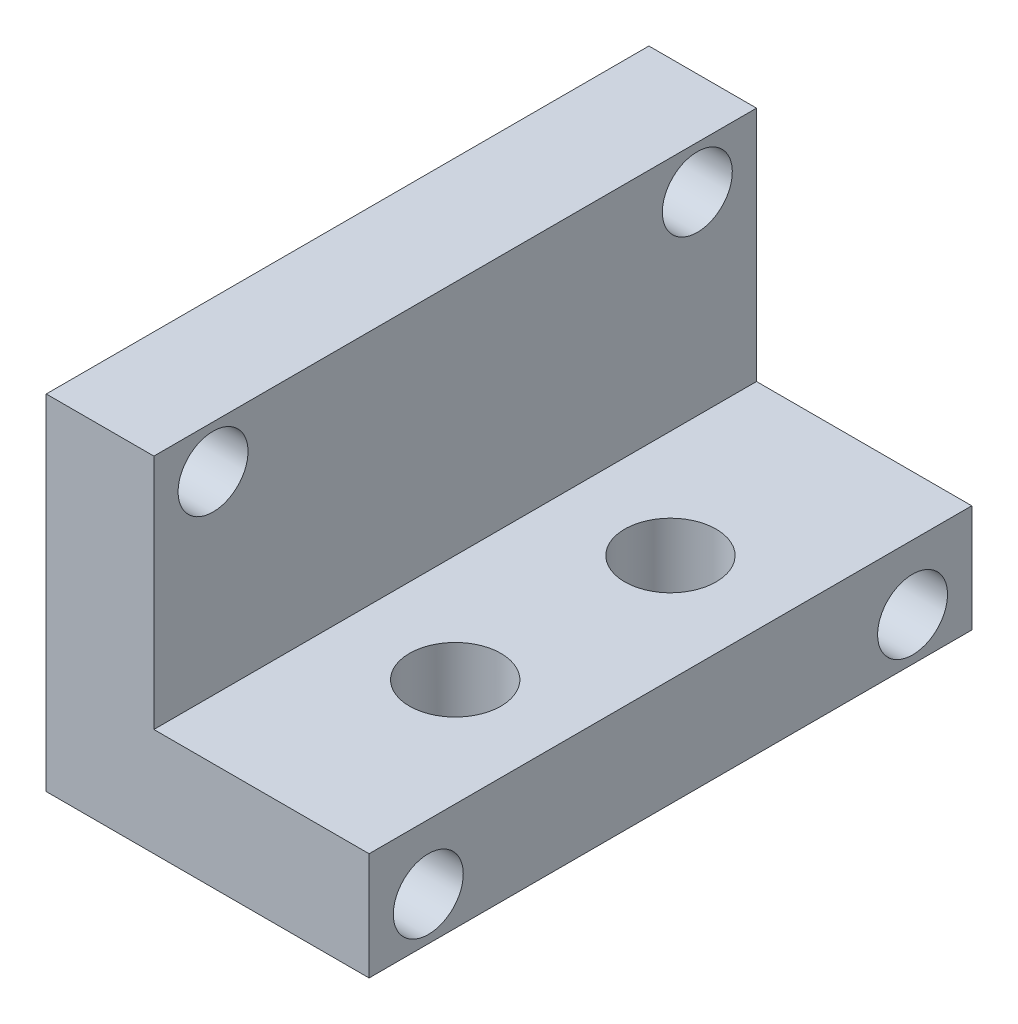
ISO-10303-21;
HEADER;
FILE_DESCRIPTION(('STEP AP214'),'2;1');
FILE_NAME('part.step','',(''),(''),'','','');
FILE_SCHEMA(('AUTOMOTIVE_DESIGN { 1 0 10303 214 1 1 1 1 }'));
ENDSEC;
DATA;
#1=APPLICATION_CONTEXT('core data for automotive mechanical design processes');
#2=APPLICATION_PROTOCOL_DEFINITION('international standard','automotive_design',2000,#1);
#3=PRODUCT_CONTEXT('',#1,'mechanical');
#4=PRODUCT('Part','Part','',(#3));
#5=PRODUCT_RELATED_PRODUCT_CATEGORY('part','',(#4));
#6=PRODUCT_DEFINITION_FORMATION('','',#4);
#7=PRODUCT_DEFINITION_CONTEXT('part definition',#1,'design');
#8=PRODUCT_DEFINITION('design','',#6,#7);
#9=PRODUCT_DEFINITION_SHAPE('','',#8);
#10=(LENGTH_UNIT() NAMED_UNIT(*) SI_UNIT(.MILLI.,.METRE.));
#11=(NAMED_UNIT(*) PLANE_ANGLE_UNIT() SI_UNIT($,.RADIAN.));
#12=(NAMED_UNIT(*) SI_UNIT($,.STERADIAN.) SOLID_ANGLE_UNIT());
#13=UNCERTAINTY_MEASURE_WITH_UNIT(LENGTH_MEASURE(1.E-05),#10,'distance_accuracy_value','');
#14=(GEOMETRIC_REPRESENTATION_CONTEXT(3) GLOBAL_UNCERTAINTY_ASSIGNED_CONTEXT((#13)) GLOBAL_UNIT_ASSIGNED_CONTEXT((#10,
#11,#12)) REPRESENTATION_CONTEXT('',''));
#15=CARTESIAN_POINT('',(0.,0.,0.));
#16=DIRECTION('',(0.,0.,1.));
#17=DIRECTION('',(1.,0.,0.));
#18=AXIS2_PLACEMENT_3D('',#15,#16,#17);
#19=CARTESIAN_POINT('',(0.,-16.,28.));
#20=DIRECTION('',(1.,0.,0.));
#21=DIRECTION('',(0.,0.,-1.));
#22=AXIS2_PLACEMENT_3D('',#19,#20,#21);
#23=PLANE('',#22);
#24=CARTESIAN_POINT('',(0.,-2.,2.75));
#25=DIRECTION('',(-1.,0.,0.));
#26=DIRECTION('',(0.,0.,-1.));
#27=AXIS2_PLACEMENT_3D('',#24,#25,#26);
#28=CIRCLE('',#27,1.625);
#29=CARTESIAN_POINT('',(0.,-2.,1.125));
#30=VERTEX_POINT('',#29);
#31=EDGE_CURVE('E155',#30,#30,#28,.T.);
#32=ORIENTED_EDGE('',*,*,#31,.F.);
#33=EDGE_LOOP('',(#32));
#34=FACE_BOUND('',#33,.T.);
#35=CARTESIAN_POINT('',(0.,-14.,25.25));
#36=DIRECTION('',(-1.,0.,0.));
#37=DIRECTION('',(0.,0.,-1.));
#38=AXIS2_PLACEMENT_3D('',#35,#36,#37);
#39=CIRCLE('',#38,1.625);
#40=CARTESIAN_POINT('',(0.,-14.,23.625));
#41=VERTEX_POINT('',#40);
#42=EDGE_CURVE('E192',#41,#41,#39,.T.);
#43=ORIENTED_EDGE('',*,*,#42,.F.);
#44=EDGE_LOOP('',(#43));
#45=FACE_BOUND('',#44,.T.);
#46=CARTESIAN_POINT('',(0.,-14.,2.75));
#47=DIRECTION('',(-1.,0.,0.));
#48=DIRECTION('',(0.,0.,1.));
#49=AXIS2_PLACEMENT_3D('',#46,#47,#48);
#50=CIRCLE('',#49,1.625);
#51=CARTESIAN_POINT('',(0.,-14.,4.375));
#52=VERTEX_POINT('',#51);
#53=EDGE_CURVE('E151',#52,#52,#50,.T.);
#54=ORIENTED_EDGE('',*,*,#53,.F.);
#55=EDGE_LOOP('',(#54));
#56=FACE_BOUND('',#55,.T.);
#57=CARTESIAN_POINT('',(0.,-2.,25.25));
#58=DIRECTION('',(-1.,0.,0.));
#59=DIRECTION('',(0.,0.,1.));
#60=AXIS2_PLACEMENT_3D('',#57,#58,#59);
#61=CIRCLE('',#60,1.625);
#62=CARTESIAN_POINT('',(0.,-2.,26.875));
#63=VERTEX_POINT('',#62);
#64=EDGE_CURVE('E141',#63,#63,#61,.T.);
#65=ORIENTED_EDGE('',*,*,#64,.F.);
#66=EDGE_LOOP('',(#65));
#67=FACE_BOUND('',#66,.T.);
#68=DIRECTION('',(0.,-1.,0.));
#69=VECTOR('',#68,1.);
#70=CARTESIAN_POINT('',(0.,-16.,0.));
#71=LINE('',#70,#69);
#72=CARTESIAN_POINT('',(0.,0.,0.));
#73=VERTEX_POINT('',#72);
#74=CARTESIAN_POINT('',(0.,-16.,0.));
#75=VERTEX_POINT('',#74);
#76=EDGE_CURVE('E124',#73,#75,#71,.T.);
#77=ORIENTED_EDGE('',*,*,#76,.T.);
#78=DIRECTION('',(0.,0.,-1.));
#79=VECTOR('',#78,1.);
#80=CARTESIAN_POINT('',(0.,-16.,28.));
#81=LINE('',#80,#79);
#82=CARTESIAN_POINT('',(0.,-16.,28.));
#83=VERTEX_POINT('',#82);
#84=EDGE_CURVE('E11',#83,#75,#81,.T.);
#85=ORIENTED_EDGE('',*,*,#84,.F.);
#86=DIRECTION('',(0.,-1.,0.));
#87=VECTOR('',#86,1.);
#88=CARTESIAN_POINT('',(0.,-16.,28.));
#89=LINE('',#88,#87);
#90=CARTESIAN_POINT('',(0.,0.,28.));
#91=VERTEX_POINT('',#90);
#92=EDGE_CURVE('E134',#91,#83,#89,.T.);
#93=ORIENTED_EDGE('',*,*,#92,.F.);
#94=DIRECTION('',(0.,0.,-1.));
#95=VECTOR('',#94,1.);
#96=CARTESIAN_POINT('',(0.,0.,28.));
#97=LINE('',#96,#95);
#98=EDGE_CURVE('E120',#91,#73,#97,.T.);
#99=ORIENTED_EDGE('',*,*,#98,.T.);
#100=EDGE_LOOP('',(#77,#85,#93,#99));
#101=FACE_BOUND('',#100,.T.);
#102=ADVANCED_FACE('F38',(#34,#45,#56,#67,#101),#23,.F.);
#103=CARTESIAN_POINT('',(15.,-16.,28.));
#104=DIRECTION('',(0.,1.,0.));
#105=DIRECTION('',(0.,0.,1.));
#106=AXIS2_PLACEMENT_3D('',#103,#104,#105);
#107=PLANE('',#106);
#108=CARTESIAN_POINT('',(10.,-16.,9.));
#109=DIRECTION('',(0.,1.,0.));
#110=DIRECTION('',(0.,0.,1.));
#111=AXIS2_PLACEMENT_3D('',#108,#109,#110);
#112=CIRCLE('',#111,2.125);
#113=CARTESIAN_POINT('',(10.,-16.,11.125));
#114=VERTEX_POINT('',#113);
#115=EDGE_CURVE('E203',#114,#114,#112,.T.);
#116=ORIENTED_EDGE('',*,*,#115,.T.);
#117=EDGE_LOOP('',(#116));
#118=FACE_BOUND('',#117,.T.);
#119=CARTESIAN_POINT('',(10.,-16.,19.));
#120=DIRECTION('',(0.,1.,0.));
#121=DIRECTION('',(0.,0.,1.));
#122=AXIS2_PLACEMENT_3D('',#119,#120,#121);
#123=CIRCLE('',#122,2.125);
#124=CARTESIAN_POINT('',(10.,-16.,21.125));
#125=VERTEX_POINT('',#124);
#126=EDGE_CURVE('E206',#125,#125,#123,.T.);
#127=ORIENTED_EDGE('',*,*,#126,.T.);
#128=EDGE_LOOP('',(#127));
#129=FACE_BOUND('',#128,.T.);
#130=DIRECTION('',(1.,0.,0.));
#131=VECTOR('',#130,1.);
#132=CARTESIAN_POINT('',(15.,-16.,0.));
#133=LINE('',#132,#131);
#134=CARTESIAN_POINT('',(15.,-16.,0.));
#135=VERTEX_POINT('',#134);
#136=EDGE_CURVE('E127',#75,#135,#133,.T.);
#137=ORIENTED_EDGE('',*,*,#136,.T.);
#138=DIRECTION('',(0.,0.,-1.));
#139=VECTOR('',#138,1.);
#140=CARTESIAN_POINT('',(15.,-16.,28.));
#141=LINE('',#140,#139);
#142=CARTESIAN_POINT('',(15.,-16.,28.));
#143=VERTEX_POINT('',#142);
#144=EDGE_CURVE('E47',#143,#135,#141,.T.);
#145=ORIENTED_EDGE('',*,*,#144,.F.);
#146=DIRECTION('',(1.,0.,0.));
#147=VECTOR('',#146,1.);
#148=CARTESIAN_POINT('',(15.,-16.,28.));
#149=LINE('',#148,#147);
#150=EDGE_CURVE('E93',#83,#143,#149,.T.);
#151=ORIENTED_EDGE('',*,*,#150,.F.);
#152=ORIENTED_EDGE('',*,*,#84,.T.);
#153=EDGE_LOOP('',(#137,#145,#151,#152));
#154=FACE_BOUND('',#153,.T.);
#155=ADVANCED_FACE('F160',(#118,#129,#154),#107,.F.);
#156=CARTESIAN_POINT('',(15.,-11.,28.));
#157=DIRECTION('',(-1.,0.,0.));
#158=DIRECTION('',(0.,0.,1.));
#159=AXIS2_PLACEMENT_3D('',#156,#157,#158);
#160=PLANE('',#159);
#161=CARTESIAN_POINT('',(15.,-14.,25.25));
#162=DIRECTION('',(-1.,0.,0.));
#163=DIRECTION('',(0.,0.,-1.));
#164=AXIS2_PLACEMENT_3D('',#161,#162,#163);
#165=CIRCLE('',#164,1.625);
#166=CARTESIAN_POINT('',(15.,-14.,23.625));
#167=VERTEX_POINT('',#166);
#168=EDGE_CURVE('E197',#167,#167,#165,.T.);
#169=ORIENTED_EDGE('',*,*,#168,.T.);
#170=EDGE_LOOP('',(#169));
#171=FACE_BOUND('',#170,.T.);
#172=CARTESIAN_POINT('',(15.,-14.,2.75));
#173=DIRECTION('',(-1.,0.,0.));
#174=DIRECTION('',(0.,0.,1.));
#175=AXIS2_PLACEMENT_3D('',#172,#173,#174);
#176=CIRCLE('',#175,1.625);
#177=CARTESIAN_POINT('',(15.,-14.,4.375));
#178=VERTEX_POINT('',#177);
#179=EDGE_CURVE('E146',#178,#178,#176,.T.);
#180=ORIENTED_EDGE('',*,*,#179,.T.);
#181=EDGE_LOOP('',(#180));
#182=FACE_BOUND('',#181,.T.);
#183=DIRECTION('',(0.,1.,0.));
#184=VECTOR('',#183,1.);
#185=CARTESIAN_POINT('',(15.,-11.,0.));
#186=LINE('',#185,#184);
#187=CARTESIAN_POINT('',(15.,-11.,0.));
#188=VERTEX_POINT('',#187);
#189=EDGE_CURVE('E129',#135,#188,#186,.T.);
#190=ORIENTED_EDGE('',*,*,#189,.T.);
#191=DIRECTION('',(0.,0.,-1.));
#192=VECTOR('',#191,1.);
#193=CARTESIAN_POINT('',(15.,-11.,28.));
#194=LINE('',#193,#192);
#195=CARTESIAN_POINT('',(15.,-11.,28.));
#196=VERTEX_POINT('',#195);
#197=EDGE_CURVE('E115',#196,#188,#194,.T.);
#198=ORIENTED_EDGE('',*,*,#197,.F.);
#199=DIRECTION('',(0.,1.,0.));
#200=VECTOR('',#199,1.);
#201=CARTESIAN_POINT('',(15.,-11.,28.));
#202=LINE('',#201,#200);
#203=EDGE_CURVE('E106',#143,#196,#202,.T.);
#204=ORIENTED_EDGE('',*,*,#203,.F.);
#205=ORIENTED_EDGE('',*,*,#144,.T.);
#206=EDGE_LOOP('',(#190,#198,#204,#205));
#207=FACE_BOUND('',#206,.T.);
#208=ADVANCED_FACE('F163',(#171,#182,#207),#160,.F.);
#209=CARTESIAN_POINT('',(5.,-11.,28.));
#210=DIRECTION('',(0.,-1.,0.));
#211=DIRECTION('',(0.,0.,-1.));
#212=AXIS2_PLACEMENT_3D('',#209,#210,#211);
#213=PLANE('',#212);
#214=CARTESIAN_POINT('',(10.,-11.,9.));
#215=DIRECTION('',(0.,1.,0.));
#216=DIRECTION('',(0.,0.,1.));
#217=AXIS2_PLACEMENT_3D('',#214,#215,#216);
#218=CIRCLE('',#217,2.125);
#219=CARTESIAN_POINT('',(10.,-11.,11.125));
#220=VERTEX_POINT('',#219);
#221=EDGE_CURVE('E209',#220,#220,#218,.T.);
#222=ORIENTED_EDGE('',*,*,#221,.F.);
#223=EDGE_LOOP('',(#222));
#224=FACE_BOUND('',#223,.T.);
#225=CARTESIAN_POINT('',(10.,-11.,19.));
#226=DIRECTION('',(0.,1.,0.));
#227=DIRECTION('',(0.,0.,-1.));
#228=AXIS2_PLACEMENT_3D('',#225,#226,#227);
#229=CIRCLE('',#228,2.125);
#230=CARTESIAN_POINT('',(10.,-11.,16.875));
#231=VERTEX_POINT('',#230);
#232=EDGE_CURVE('E212',#231,#231,#229,.T.);
#233=ORIENTED_EDGE('',*,*,#232,.F.);
#234=EDGE_LOOP('',(#233));
#235=FACE_BOUND('',#234,.T.);
#236=DIRECTION('',(-1.,0.,0.));
#237=VECTOR('',#236,1.);
#238=CARTESIAN_POINT('',(5.,-11.,0.));
#239=LINE('',#238,#237);
#240=CARTESIAN_POINT('',(5.,-11.,0.));
#241=VERTEX_POINT('',#240);
#242=EDGE_CURVE('E114',#188,#241,#239,.T.);
#243=ORIENTED_EDGE('',*,*,#242,.T.);
#244=DIRECTION('',(0.,0.,-1.));
#245=VECTOR('',#244,1.);
#246=CARTESIAN_POINT('',(5.,-11.,28.));
#247=LINE('',#246,#245);
#248=CARTESIAN_POINT('',(5.,-11.,28.));
#249=VERTEX_POINT('',#248);
#250=EDGE_CURVE('E111',#249,#241,#247,.T.);
#251=ORIENTED_EDGE('',*,*,#250,.F.);
#252=DIRECTION('',(-1.,0.,0.));
#253=VECTOR('',#252,1.);
#254=CARTESIAN_POINT('',(5.,-11.,28.));
#255=LINE('',#254,#253);
#256=EDGE_CURVE('E100',#196,#249,#255,.T.);
#257=ORIENTED_EDGE('',*,*,#256,.F.);
#258=ORIENTED_EDGE('',*,*,#197,.T.);
#259=EDGE_LOOP('',(#243,#251,#257,#258));
#260=FACE_BOUND('',#259,.T.);
#261=ADVANCED_FACE('F112',(#224,#235,#260),#213,.F.);
#262=CARTESIAN_POINT('',(5.,0.,28.));
#263=DIRECTION('',(-1.,0.,0.));
#264=DIRECTION('',(0.,-1.,0.));
#265=AXIS2_PLACEMENT_3D('',#262,#263,#264);
#266=PLANE('',#265);
#267=CARTESIAN_POINT('',(5.,-2.,2.75));
#268=DIRECTION('',(-1.,0.,0.));
#269=DIRECTION('',(0.,-1.,0.));
#270=AXIS2_PLACEMENT_3D('',#267,#268,#269);
#271=CIRCLE('',#270,1.625);
#272=CARTESIAN_POINT('',(5.,-3.625,2.75));
#273=VERTEX_POINT('',#272);
#274=EDGE_CURVE('E41',#273,#273,#271,.T.);
#275=ORIENTED_EDGE('',*,*,#274,.T.);
#276=EDGE_LOOP('',(#275));
#277=FACE_BOUND('',#276,.T.);
#278=CARTESIAN_POINT('',(5.,-2.,25.25));
#279=DIRECTION('',(-1.,0.,0.));
#280=DIRECTION('',(0.,-1.,0.));
#281=AXIS2_PLACEMENT_3D('',#278,#279,#280);
#282=CIRCLE('',#281,1.625);
#283=CARTESIAN_POINT('',(5.,-3.625,25.25));
#284=VERTEX_POINT('',#283);
#285=EDGE_CURVE('E139',#284,#284,#282,.T.);
#286=ORIENTED_EDGE('',*,*,#285,.T.);
#287=EDGE_LOOP('',(#286));
#288=FACE_BOUND('',#287,.T.);
#289=DIRECTION('',(0.,1.,0.));
#290=VECTOR('',#289,1.);
#291=CARTESIAN_POINT('',(5.,0.,0.));
#292=LINE('',#291,#290);
#293=CARTESIAN_POINT('',(5.,0.,0.));
#294=VERTEX_POINT('',#293);
#295=EDGE_CURVE('E79',#241,#294,#292,.T.);
#296=ORIENTED_EDGE('',*,*,#295,.T.);
#297=DIRECTION('',(0.,0.,-1.));
#298=VECTOR('',#297,1.);
#299=CARTESIAN_POINT('',(5.,0.,28.));
#300=LINE('',#299,#298);
#301=CARTESIAN_POINT('',(5.,0.,28.));
#302=VERTEX_POINT('',#301);
#303=EDGE_CURVE('E116',#302,#294,#300,.T.);
#304=ORIENTED_EDGE('',*,*,#303,.F.);
#305=DIRECTION('',(0.,1.,0.));
#306=VECTOR('',#305,1.);
#307=CARTESIAN_POINT('',(5.,0.,28.));
#308=LINE('',#307,#306);
#309=EDGE_CURVE('E104',#249,#302,#308,.T.);
#310=ORIENTED_EDGE('',*,*,#309,.F.);
#311=ORIENTED_EDGE('',*,*,#250,.T.);
#312=EDGE_LOOP('',(#296,#304,#310,#311));
#313=FACE_BOUND('',#312,.T.);
#314=ADVANCED_FACE('F118',(#277,#288,#313),#266,.F.);
#315=CARTESIAN_POINT('',(0.,0.,28.));
#316=DIRECTION('',(0.,-1.,0.));
#317=DIRECTION('',(0.,0.,-1.));
#318=AXIS2_PLACEMENT_3D('',#315,#316,#317);
#319=PLANE('',#318);
#320=DIRECTION('',(-1.,0.,0.));
#321=VECTOR('',#320,1.);
#322=CARTESIAN_POINT('',(0.,0.,0.));
#323=LINE('',#322,#321);
#324=EDGE_CURVE('E85',#294,#73,#323,.T.);
#325=ORIENTED_EDGE('',*,*,#324,.T.);
#326=ORIENTED_EDGE('',*,*,#98,.F.);
#327=DIRECTION('',(-1.,0.,0.));
#328=VECTOR('',#327,1.);
#329=CARTESIAN_POINT('',(0.,0.,28.));
#330=LINE('',#329,#328);
#331=EDGE_CURVE('E56',#302,#91,#330,.T.);
#332=ORIENTED_EDGE('',*,*,#331,.F.);
#333=ORIENTED_EDGE('',*,*,#303,.T.);
#334=EDGE_LOOP('',(#325,#326,#332,#333));
#335=FACE_BOUND('',#334,.T.);
#336=ADVANCED_FACE('F168',(#335),#319,.F.);
#337=CARTESIAN_POINT('',(0.,0.,28.));
#338=DIRECTION('',(0.,0.,-1.));
#339=DIRECTION('',(-1.,0.,0.));
#340=AXIS2_PLACEMENT_3D('',#337,#338,#339);
#341=PLANE('',#340);
#342=ORIENTED_EDGE('',*,*,#92,.T.);
#343=ORIENTED_EDGE('',*,*,#150,.T.);
#344=ORIENTED_EDGE('',*,*,#203,.T.);
#345=ORIENTED_EDGE('',*,*,#256,.T.);
#346=ORIENTED_EDGE('',*,*,#309,.T.);
#347=ORIENTED_EDGE('',*,*,#331,.T.);
#348=EDGE_LOOP('',(#342,#343,#344,#345,#346,#347));
#349=FACE_BOUND('',#348,.T.);
#350=ADVANCED_FACE('F102',(#349),#341,.F.);
#351=CARTESIAN_POINT('',(0.,0.,0.));
#352=DIRECTION('',(0.,0.,-1.));
#353=DIRECTION('',(-1.,0.,0.));
#354=AXIS2_PLACEMENT_3D('',#351,#352,#353);
#355=PLANE('',#354);
#356=ORIENTED_EDGE('',*,*,#76,.F.);
#357=ORIENTED_EDGE('',*,*,#324,.F.);
#358=ORIENTED_EDGE('',*,*,#295,.F.);
#359=ORIENTED_EDGE('',*,*,#242,.F.);
#360=ORIENTED_EDGE('',*,*,#189,.F.);
#361=ORIENTED_EDGE('',*,*,#136,.F.);
#362=EDGE_LOOP('',(#356,#357,#358,#359,#360,#361));
#363=FACE_BOUND('',#362,.T.);
#364=ADVANCED_FACE('F166',(#363),#355,.T.);
#365=CARTESIAN_POINT('',(15.,-2.,25.25));
#366=DIRECTION('',(-1.,0.,0.));
#367=DIRECTION('',(0.,0.,1.));
#368=AXIS2_PLACEMENT_3D('',#365,#366,#367);
#369=CYLINDRICAL_SURFACE('',#368,1.625);
#370=ORIENTED_EDGE('',*,*,#64,.T.);
#371=EDGE_LOOP('',(#370));
#372=FACE_BOUND('',#371,.T.);
#373=ORIENTED_EDGE('',*,*,#285,.F.);
#374=EDGE_LOOP('',(#373));
#375=FACE_BOUND('',#374,.T.);
#376=ADVANCED_FACE('F248',(#372,#375),#369,.F.);
#377=CARTESIAN_POINT('',(15.,-2.,2.75));
#378=DIRECTION('',(-1.,0.,0.));
#379=DIRECTION('',(0.,0.,1.));
#380=AXIS2_PLACEMENT_3D('',#377,#378,#379);
#381=CYLINDRICAL_SURFACE('',#380,1.625);
#382=ORIENTED_EDGE('',*,*,#31,.T.);
#383=EDGE_LOOP('',(#382));
#384=FACE_BOUND('',#383,.T.);
#385=ORIENTED_EDGE('',*,*,#274,.F.);
#386=EDGE_LOOP('',(#385));
#387=FACE_BOUND('',#386,.T.);
#388=ADVANCED_FACE('F243',(#384,#387),#381,.F.);
#389=CARTESIAN_POINT('',(15.,-14.,2.75));
#390=DIRECTION('',(-1.,0.,0.));
#391=DIRECTION('',(0.,0.,1.));
#392=AXIS2_PLACEMENT_3D('',#389,#390,#391);
#393=CYLINDRICAL_SURFACE('',#392,1.625);
#394=ORIENTED_EDGE('',*,*,#179,.F.);
#395=EDGE_LOOP('',(#394));
#396=FACE_BOUND('',#395,.T.);
#397=ORIENTED_EDGE('',*,*,#53,.T.);
#398=EDGE_LOOP('',(#397));
#399=FACE_BOUND('',#398,.T.);
#400=ADVANCED_FACE('F238',(#396,#399),#393,.F.);
#401=CARTESIAN_POINT('',(15.,-14.,25.25));
#402=DIRECTION('',(-1.,0.,0.));
#403=DIRECTION('',(0.,0.,1.));
#404=AXIS2_PLACEMENT_3D('',#401,#402,#403);
#405=CYLINDRICAL_SURFACE('',#404,1.625);
#406=ORIENTED_EDGE('',*,*,#168,.F.);
#407=EDGE_LOOP('',(#406));
#408=FACE_BOUND('',#407,.T.);
#409=ORIENTED_EDGE('',*,*,#42,.T.);
#410=EDGE_LOOP('',(#409));
#411=FACE_BOUND('',#410,.T.);
#412=ADVANCED_FACE('F229',(#408,#411),#405,.F.);
#413=CARTESIAN_POINT('',(10.,-21.,19.));
#414=DIRECTION('',(0.,1.,0.));
#415=DIRECTION('',(0.,0.,1.));
#416=AXIS2_PLACEMENT_3D('',#413,#414,#415);
#417=CYLINDRICAL_SURFACE('',#416,2.125);
#418=ORIENTED_EDGE('',*,*,#232,.T.);
#419=EDGE_LOOP('',(#418));
#420=FACE_BOUND('',#419,.T.);
#421=ORIENTED_EDGE('',*,*,#126,.F.);
#422=EDGE_LOOP('',(#421));
#423=FACE_BOUND('',#422,.T.);
#424=ADVANCED_FACE('F226',(#420,#423),#417,.F.);
#425=CARTESIAN_POINT('',(10.,-21.,9.));
#426=DIRECTION('',(0.,1.,0.));
#427=DIRECTION('',(0.,0.,1.));
#428=AXIS2_PLACEMENT_3D('',#425,#426,#427);
#429=CYLINDRICAL_SURFACE('',#428,2.125);
#430=ORIENTED_EDGE('',*,*,#221,.T.);
#431=EDGE_LOOP('',(#430));
#432=FACE_BOUND('',#431,.T.);
#433=ORIENTED_EDGE('',*,*,#115,.F.);
#434=EDGE_LOOP('',(#433));
#435=FACE_BOUND('',#434,.T.);
#436=ADVANCED_FACE('F218',(#432,#435),#429,.F.);
#437=CLOSED_SHELL('',(#102,#155,#208,#261,#314,#336,#350,#364,#376,#388,#400,#412,#424,#436));
#438=MANIFOLD_SOLID_BREP('B2',#437);
#439=ADVANCED_BREP_SHAPE_REPRESENTATION('',(#18,#438),#14);
#440=SHAPE_DEFINITION_REPRESENTATION(#9,#439);
ENDSEC;
END-ISO-10303-21;
